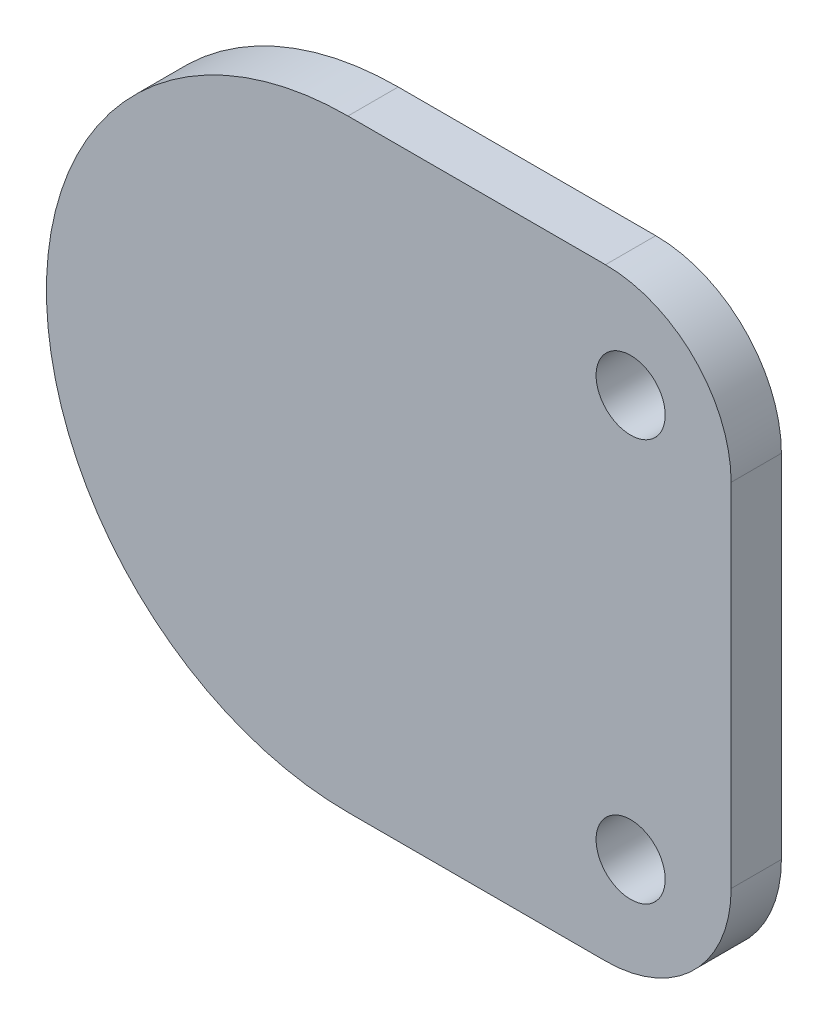
ISO-10303-21;
HEADER;
FILE_DESCRIPTION(('STEP AP214'),'2;1');
FILE_NAME('part.step','',(''),(''),'','','');
FILE_SCHEMA(('AUTOMOTIVE_DESIGN { 1 0 10303 214 1 1 1 1 }'));
ENDSEC;
DATA;
#1=APPLICATION_CONTEXT('core data for automotive mechanical design processes');
#2=APPLICATION_PROTOCOL_DEFINITION('international standard','automotive_design',2000,#1);
#3=PRODUCT_CONTEXT('',#1,'mechanical');
#4=PRODUCT('Part','Part','',(#3));
#5=PRODUCT_RELATED_PRODUCT_CATEGORY('part','',(#4));
#6=PRODUCT_DEFINITION_FORMATION('','',#4);
#7=PRODUCT_DEFINITION_CONTEXT('part definition',#1,'design');
#8=PRODUCT_DEFINITION('design','',#6,#7);
#9=PRODUCT_DEFINITION_SHAPE('','',#8);
#10=(LENGTH_UNIT() NAMED_UNIT(*) SI_UNIT(.MILLI.,.METRE.));
#11=(NAMED_UNIT(*) PLANE_ANGLE_UNIT() SI_UNIT($,.RADIAN.));
#12=(NAMED_UNIT(*) SI_UNIT($,.STERADIAN.) SOLID_ANGLE_UNIT());
#13=UNCERTAINTY_MEASURE_WITH_UNIT(LENGTH_MEASURE(1.E-05),#10,'distance_accuracy_value','');
#14=(GEOMETRIC_REPRESENTATION_CONTEXT(3) GLOBAL_UNCERTAINTY_ASSIGNED_CONTEXT((#13)) GLOBAL_UNIT_ASSIGNED_CONTEXT((#10,
#11,#12)) REPRESENTATION_CONTEXT('',''));
#15=CARTESIAN_POINT('',(0.,0.,0.));
#16=DIRECTION('',(0.,0.,1.));
#17=DIRECTION('',(1.,0.,0.));
#18=AXIS2_PLACEMENT_3D('',#15,#16,#17);
#19=CARTESIAN_POINT('',(0.,0.,4.));
#20=DIRECTION('',(0.,0.,1.));
#21=DIRECTION('',(1.,0.,0.));
#22=AXIS2_PLACEMENT_3D('',#19,#20,#21);
#23=PLANE('',#22);
#24=CARTESIAN_POINT('',(22.5,-16.,4.));
#25=DIRECTION('',(0.,0.,1.));
#26=DIRECTION('',(1.,0.,0.));
#27=AXIS2_PLACEMENT_3D('',#24,#25,#26);
#28=CIRCLE('',#27,2.74999999999999);
#29=CARTESIAN_POINT('',(25.25,-16.,4.));
#30=VERTEX_POINT('',#29);
#31=EDGE_CURVE('E126',#30,#30,#28,.T.);
#32=ORIENTED_EDGE('',*,*,#31,.F.);
#33=EDGE_LOOP('',(#32));
#34=FACE_BOUND('',#33,.T.);
#35=CARTESIAN_POINT('',(0.,0.,4.));
#36=DIRECTION('',(0.,0.,1.));
#37=DIRECTION('',(1.,0.,0.));
#38=AXIS2_PLACEMENT_3D('',#35,#36,#37);
#39=CIRCLE('',#38,24.);
#40=CARTESIAN_POINT('',(0.,24.,4.));
#41=VERTEX_POINT('',#40);
#42=CARTESIAN_POINT('',(0.,-24.,4.));
#43=VERTEX_POINT('',#42);
#44=EDGE_CURVE('E133',#41,#43,#39,.T.);
#45=ORIENTED_EDGE('',*,*,#44,.T.);
#46=DIRECTION('',(1.,0.,0.));
#47=VECTOR('',#46,1.);
#48=CARTESIAN_POINT('',(0.,-24.,4.));
#49=LINE('',#48,#47);
#50=CARTESIAN_POINT('',(20.5,-24.,4.));
#51=VERTEX_POINT('',#50);
#52=EDGE_CURVE('E91',#43,#51,#49,.T.);
#53=ORIENTED_EDGE('',*,*,#52,.T.);
#54=CARTESIAN_POINT('',(20.5,-14.,4.));
#55=DIRECTION('',(0.,0.,1.));
#56=DIRECTION('',(1.,0.,0.));
#57=AXIS2_PLACEMENT_3D('',#54,#55,#56);
#58=CIRCLE('',#57,10.);
#59=CARTESIAN_POINT('',(30.5,-14.,4.));
#60=VERTEX_POINT('',#59);
#61=EDGE_CURVE('E104',#51,#60,#58,.T.);
#62=ORIENTED_EDGE('',*,*,#61,.T.);
#63=DIRECTION('',(0.,1.,0.));
#64=VECTOR('',#63,1.);
#65=CARTESIAN_POINT('',(30.5,-14.,4.));
#66=LINE('',#65,#64);
#67=CARTESIAN_POINT('',(30.5,14.,4.));
#68=VERTEX_POINT('',#67);
#69=EDGE_CURVE('E98',#60,#68,#66,.T.);
#70=ORIENTED_EDGE('',*,*,#69,.T.);
#71=CARTESIAN_POINT('',(20.5,14.,4.));
#72=DIRECTION('',(0.,0.,1.));
#73=DIRECTION('',(1.,0.,0.));
#74=AXIS2_PLACEMENT_3D('',#71,#72,#73);
#75=CIRCLE('',#74,10.);
#76=CARTESIAN_POINT('',(20.5,24.,4.));
#77=VERTEX_POINT('',#76);
#78=EDGE_CURVE('E102',#68,#77,#75,.T.);
#79=ORIENTED_EDGE('',*,*,#78,.T.);
#80=DIRECTION('',(-1.,0.,0.));
#81=VECTOR('',#80,1.);
#82=CARTESIAN_POINT('',(20.5,24.,4.));
#83=LINE('',#82,#81);
#84=EDGE_CURVE('E53',#77,#41,#83,.T.);
#85=ORIENTED_EDGE('',*,*,#84,.T.);
#86=EDGE_LOOP('',(#45,#53,#62,#70,#79,#85));
#87=FACE_BOUND('',#86,.T.);
#88=CARTESIAN_POINT('',(22.5,16.,4.));
#89=DIRECTION('',(0.,0.,1.));
#90=DIRECTION('',(1.,0.,0.));
#91=AXIS2_PLACEMENT_3D('',#88,#89,#90);
#92=CIRCLE('',#91,2.74999999999999);
#93=CARTESIAN_POINT('',(25.25,16.,4.));
#94=VERTEX_POINT('',#93);
#95=EDGE_CURVE('E156',#94,#94,#92,.T.);
#96=ORIENTED_EDGE('',*,*,#95,.F.);
#97=EDGE_LOOP('',(#96));
#98=FACE_BOUND('',#97,.T.);
#99=ADVANCED_FACE('F36',(#34,#87,#98),#23,.T.);
#100=CARTESIAN_POINT('',(0.,0.,0.));
#101=DIRECTION('',(0.,0.,1.));
#102=DIRECTION('',(1.,0.,0.));
#103=AXIS2_PLACEMENT_3D('',#100,#101,#102);
#104=PLANE('',#103);
#105=CARTESIAN_POINT('',(0.,0.,0.));
#106=DIRECTION('',(0.,0.,1.));
#107=DIRECTION('',(1.,0.,0.));
#108=AXIS2_PLACEMENT_3D('',#105,#106,#107);
#109=CIRCLE('',#108,16.);
#110=CARTESIAN_POINT('',(16.,0.,0.));
#111=VERTEX_POINT('',#110);
#112=EDGE_CURVE('E11',#111,#111,#109,.F.);
#113=ORIENTED_EDGE('',*,*,#112,.F.);
#114=EDGE_LOOP('',(#113));
#115=FACE_BOUND('',#114,.T.);
#116=CARTESIAN_POINT('',(0.,0.,0.));
#117=DIRECTION('',(0.,0.,1.));
#118=DIRECTION('',(1.,0.,0.));
#119=AXIS2_PLACEMENT_3D('',#116,#117,#118);
#120=CIRCLE('',#119,24.);
#121=CARTESIAN_POINT('',(0.,24.,0.));
#122=VERTEX_POINT('',#121);
#123=CARTESIAN_POINT('',(0.,-24.,0.));
#124=VERTEX_POINT('',#123);
#125=EDGE_CURVE('E122',#122,#124,#120,.T.);
#126=ORIENTED_EDGE('',*,*,#125,.F.);
#127=DIRECTION('',(-1.,0.,0.));
#128=VECTOR('',#127,1.);
#129=CARTESIAN_POINT('',(20.5,24.,0.));
#130=LINE('',#129,#128);
#131=CARTESIAN_POINT('',(20.5,24.,0.));
#132=VERTEX_POINT('',#131);
#133=EDGE_CURVE('E82',#132,#122,#130,.T.);
#134=ORIENTED_EDGE('',*,*,#133,.F.);
#135=CARTESIAN_POINT('',(20.5,14.,0.));
#136=DIRECTION('',(0.,0.,1.));
#137=DIRECTION('',(1.,0.,0.));
#138=AXIS2_PLACEMENT_3D('',#135,#136,#137);
#139=CIRCLE('',#138,10.);
#140=CARTESIAN_POINT('',(30.5,14.,0.));
#141=VERTEX_POINT('',#140);
#142=EDGE_CURVE('E76',#141,#132,#139,.T.);
#143=ORIENTED_EDGE('',*,*,#142,.F.);
#144=DIRECTION('',(0.,1.,0.));
#145=VECTOR('',#144,1.);
#146=CARTESIAN_POINT('',(30.5,-14.,0.));
#147=LINE('',#146,#145);
#148=CARTESIAN_POINT('',(30.5,-14.,0.));
#149=VERTEX_POINT('',#148);
#150=EDGE_CURVE('E112',#149,#141,#147,.T.);
#151=ORIENTED_EDGE('',*,*,#150,.F.);
#152=CARTESIAN_POINT('',(20.5,-14.,0.));
#153=DIRECTION('',(0.,0.,1.));
#154=DIRECTION('',(1.,0.,0.));
#155=AXIS2_PLACEMENT_3D('',#152,#153,#154);
#156=CIRCLE('',#155,10.);
#157=CARTESIAN_POINT('',(20.5,-24.,0.));
#158=VERTEX_POINT('',#157);
#159=EDGE_CURVE('E128',#158,#149,#156,.T.);
#160=ORIENTED_EDGE('',*,*,#159,.F.);
#161=DIRECTION('',(1.,0.,0.));
#162=VECTOR('',#161,1.);
#163=CARTESIAN_POINT('',(0.,-24.,0.));
#164=LINE('',#163,#162);
#165=EDGE_CURVE('E125',#124,#158,#164,.T.);
#166=ORIENTED_EDGE('',*,*,#165,.F.);
#167=EDGE_LOOP('',(#126,#134,#143,#151,#160,#166));
#168=FACE_BOUND('',#167,.T.);
#169=CARTESIAN_POINT('',(22.5,-16.,0.));
#170=DIRECTION('',(0.,0.,1.));
#171=DIRECTION('',(1.,0.,0.));
#172=AXIS2_PLACEMENT_3D('',#169,#170,#171);
#173=CIRCLE('',#172,2.74999999999999);
#174=CARTESIAN_POINT('',(25.25,-16.,0.));
#175=VERTEX_POINT('',#174);
#176=EDGE_CURVE('E153',#175,#175,#173,.T.);
#177=ORIENTED_EDGE('',*,*,#176,.T.);
#178=EDGE_LOOP('',(#177));
#179=FACE_BOUND('',#178,.T.);
#180=CARTESIAN_POINT('',(22.5,16.,0.));
#181=DIRECTION('',(0.,0.,1.));
#182=DIRECTION('',(1.,0.,0.));
#183=AXIS2_PLACEMENT_3D('',#180,#181,#182);
#184=CIRCLE('',#183,2.74999999999999);
#185=CARTESIAN_POINT('',(25.25,16.,0.));
#186=VERTEX_POINT('',#185);
#187=EDGE_CURVE('E159',#186,#186,#184,.T.);
#188=ORIENTED_EDGE('',*,*,#187,.T.);
#189=EDGE_LOOP('',(#188));
#190=FACE_BOUND('',#189,.T.);
#191=ADVANCED_FACE('F145',(#115,#168,#179,#190),#104,.F.);
#192=CARTESIAN_POINT('',(0.,0.,4.));
#193=DIRECTION('',(0.,0.,-1.));
#194=DIRECTION('',(-1.,0.,0.));
#195=AXIS2_PLACEMENT_3D('',#192,#193,#194);
#196=CYLINDRICAL_SURFACE('',#195,24.);
#197=ORIENTED_EDGE('',*,*,#125,.T.);
#198=DIRECTION('',(0.,0.,-1.));
#199=VECTOR('',#198,1.);
#200=CARTESIAN_POINT('',(0.,-24.,4.));
#201=LINE('',#200,#199);
#202=EDGE_CURVE('E45',#43,#124,#201,.T.);
#203=ORIENTED_EDGE('',*,*,#202,.F.);
#204=ORIENTED_EDGE('',*,*,#44,.F.);
#205=DIRECTION('',(0.,0.,-1.));
#206=VECTOR('',#205,1.);
#207=CARTESIAN_POINT('',(0.,24.,4.));
#208=LINE('',#207,#206);
#209=EDGE_CURVE('E118',#41,#122,#208,.T.);
#210=ORIENTED_EDGE('',*,*,#209,.T.);
#211=EDGE_LOOP('',(#197,#203,#204,#210));
#212=FACE_BOUND('',#211,.T.);
#213=ADVANCED_FACE('F38',(#212),#196,.T.);
#214=CARTESIAN_POINT('',(0.,-24.,4.));
#215=DIRECTION('',(0.,1.,0.));
#216=DIRECTION('',(0.,0.,1.));
#217=AXIS2_PLACEMENT_3D('',#214,#215,#216);
#218=PLANE('',#217);
#219=ORIENTED_EDGE('',*,*,#165,.T.);
#220=DIRECTION('',(0.,0.,-1.));
#221=VECTOR('',#220,1.);
#222=CARTESIAN_POINT('',(20.5,-24.,4.));
#223=LINE('',#222,#221);
#224=EDGE_CURVE('E137',#51,#158,#223,.T.);
#225=ORIENTED_EDGE('',*,*,#224,.F.);
#226=ORIENTED_EDGE('',*,*,#52,.F.);
#227=ORIENTED_EDGE('',*,*,#202,.T.);
#228=EDGE_LOOP('',(#219,#225,#226,#227));
#229=FACE_BOUND('',#228,.T.);
#230=ADVANCED_FACE('F140',(#229),#218,.F.);
#231=CARTESIAN_POINT('',(20.5,-14.,4.));
#232=DIRECTION('',(0.,0.,-1.));
#233=DIRECTION('',(-1.,0.,0.));
#234=AXIS2_PLACEMENT_3D('',#231,#232,#233);
#235=CYLINDRICAL_SURFACE('',#234,10.);
#236=ORIENTED_EDGE('',*,*,#159,.T.);
#237=DIRECTION('',(0.,0.,-1.));
#238=VECTOR('',#237,1.);
#239=CARTESIAN_POINT('',(30.5,-14.,4.));
#240=LINE('',#239,#238);
#241=EDGE_CURVE('E113',#60,#149,#240,.T.);
#242=ORIENTED_EDGE('',*,*,#241,.F.);
#243=ORIENTED_EDGE('',*,*,#61,.F.);
#244=ORIENTED_EDGE('',*,*,#224,.T.);
#245=EDGE_LOOP('',(#236,#242,#243,#244));
#246=FACE_BOUND('',#245,.T.);
#247=ADVANCED_FACE('F149',(#246),#235,.T.);
#248=CARTESIAN_POINT('',(30.5,-14.,4.));
#249=DIRECTION('',(-1.,0.,0.));
#250=DIRECTION('',(0.,-1.,0.));
#251=AXIS2_PLACEMENT_3D('',#248,#249,#250);
#252=PLANE('',#251);
#253=ORIENTED_EDGE('',*,*,#150,.T.);
#254=DIRECTION('',(0.,0.,-1.));
#255=VECTOR('',#254,1.);
#256=CARTESIAN_POINT('',(30.5,14.,4.));
#257=LINE('',#256,#255);
#258=EDGE_CURVE('E109',#68,#141,#257,.T.);
#259=ORIENTED_EDGE('',*,*,#258,.F.);
#260=ORIENTED_EDGE('',*,*,#69,.F.);
#261=ORIENTED_EDGE('',*,*,#241,.T.);
#262=EDGE_LOOP('',(#253,#259,#260,#261));
#263=FACE_BOUND('',#262,.T.);
#264=ADVANCED_FACE('F110',(#263),#252,.F.);
#265=CARTESIAN_POINT('',(20.5,14.,4.));
#266=DIRECTION('',(0.,0.,-1.));
#267=DIRECTION('',(-1.,0.,0.));
#268=AXIS2_PLACEMENT_3D('',#265,#266,#267);
#269=CYLINDRICAL_SURFACE('',#268,10.);
#270=ORIENTED_EDGE('',*,*,#142,.T.);
#271=DIRECTION('',(0.,0.,-1.));
#272=VECTOR('',#271,1.);
#273=CARTESIAN_POINT('',(20.5,24.,4.));
#274=LINE('',#273,#272);
#275=EDGE_CURVE('E114',#77,#132,#274,.T.);
#276=ORIENTED_EDGE('',*,*,#275,.F.);
#277=ORIENTED_EDGE('',*,*,#78,.F.);
#278=ORIENTED_EDGE('',*,*,#258,.T.);
#279=EDGE_LOOP('',(#270,#276,#277,#278));
#280=FACE_BOUND('',#279,.T.);
#281=ADVANCED_FACE('F116',(#280),#269,.T.);
#282=CARTESIAN_POINT('',(20.5,24.,4.));
#283=DIRECTION('',(0.,-1.,0.));
#284=DIRECTION('',(0.,0.,-1.));
#285=AXIS2_PLACEMENT_3D('',#282,#283,#284);
#286=PLANE('',#285);
#287=ORIENTED_EDGE('',*,*,#133,.T.);
#288=ORIENTED_EDGE('',*,*,#209,.F.);
#289=ORIENTED_EDGE('',*,*,#84,.F.);
#290=ORIENTED_EDGE('',*,*,#275,.T.);
#291=EDGE_LOOP('',(#287,#288,#289,#290));
#292=FACE_BOUND('',#291,.T.);
#293=ADVANCED_FACE('F205',(#292),#286,.F.);
#294=CARTESIAN_POINT('',(22.5,-16.,4.));
#295=DIRECTION('',(0.,0.,-1.));
#296=DIRECTION('',(-1.,0.,0.));
#297=AXIS2_PLACEMENT_3D('',#294,#295,#296);
#298=CYLINDRICAL_SURFACE('',#297,2.74999999999999);
#299=ORIENTED_EDGE('',*,*,#31,.T.);
#300=EDGE_LOOP('',(#299));
#301=FACE_BOUND('',#300,.T.);
#302=ORIENTED_EDGE('',*,*,#176,.F.);
#303=EDGE_LOOP('',(#302));
#304=FACE_BOUND('',#303,.T.);
#305=ADVANCED_FACE('F189',(#301,#304),#298,.F.);
#306=CARTESIAN_POINT('',(22.5,16.,4.));
#307=DIRECTION('',(0.,0.,-1.));
#308=DIRECTION('',(-1.,0.,0.));
#309=AXIS2_PLACEMENT_3D('',#306,#307,#308);
#310=CYLINDRICAL_SURFACE('',#309,2.74999999999999);
#311=ORIENTED_EDGE('',*,*,#95,.T.);
#312=EDGE_LOOP('',(#311));
#313=FACE_BOUND('',#312,.T.);
#314=ORIENTED_EDGE('',*,*,#187,.F.);
#315=EDGE_LOOP('',(#314));
#316=FACE_BOUND('',#315,.T.);
#317=ADVANCED_FACE('F180',(#313,#316),#310,.F.);
#318=CARTESIAN_POINT('',(0.,0.,-6.));
#319=DIRECTION('',(0.,0.,-1.));
#320=DIRECTION('',(-1.,0.,0.));
#321=AXIS2_PLACEMENT_3D('',#318,#319,#320);
#322=PLANE('',#321);
#323=CARTESIAN_POINT('',(0.,0.,-6.));
#324=DIRECTION('',(0.,0.,-1.));
#325=DIRECTION('',(-1.,0.,0.));
#326=AXIS2_PLACEMENT_3D('',#323,#324,#325);
#327=CIRCLE('',#326,16.);
#328=CARTESIAN_POINT('',(-16.,0.,-6.));
#329=VERTEX_POINT('',#328);
#330=EDGE_CURVE('E162',#329,#329,#327,.T.);
#331=ORIENTED_EDGE('',*,*,#330,.T.);
#332=EDGE_LOOP('',(#331));
#333=FACE_BOUND('',#332,.T.);
#334=CARTESIAN_POINT('',(0.,0.,-6.));
#335=DIRECTION('',(0.,0.,-1.));
#336=DIRECTION('',(-1.,0.,0.));
#337=AXIS2_PLACEMENT_3D('',#334,#335,#336);
#338=CIRCLE('',#337,14.);
#339=CARTESIAN_POINT('',(-14.,0.,-6.));
#340=VERTEX_POINT('',#339);
#341=EDGE_CURVE('E167',#340,#340,#338,.T.);
#342=ORIENTED_EDGE('',*,*,#341,.F.);
#343=EDGE_LOOP('',(#342));
#344=FACE_BOUND('',#343,.T.);
#345=ADVANCED_FACE('F177',(#333,#344),#322,.T.);
#346=CARTESIAN_POINT('',(0.,0.,-6.));
#347=DIRECTION('',(0.,0.,1.));
#348=DIRECTION('',(1.,0.,0.));
#349=AXIS2_PLACEMENT_3D('',#346,#347,#348);
#350=CYLINDRICAL_SURFACE('',#349,16.);
#351=ORIENTED_EDGE('',*,*,#330,.F.);
#352=EDGE_LOOP('',(#351));
#353=FACE_BOUND('',#352,.T.);
#354=ORIENTED_EDGE('',*,*,#112,.T.);
#355=EDGE_LOOP('',(#354));
#356=FACE_BOUND('',#355,.T.);
#357=ADVANCED_FACE('F179',(#353,#356),#350,.T.);
#358=CARTESIAN_POINT('',(0.,0.,-6.));
#359=DIRECTION('',(0.,0.,1.));
#360=DIRECTION('',(1.,0.,0.));
#361=AXIS2_PLACEMENT_3D('',#358,#359,#360);
#362=CYLINDRICAL_SURFACE('',#361,14.);
#363=ORIENTED_EDGE('',*,*,#341,.T.);
#364=EDGE_LOOP('',(#363));
#365=FACE_BOUND('',#364,.T.);
#366=CARTESIAN_POINT('',(0.,0.,0.));
#367=DIRECTION('',(0.,0.,-1.));
#368=DIRECTION('',(-1.,0.,0.));
#369=AXIS2_PLACEMENT_3D('',#366,#367,#368);
#370=CIRCLE('',#369,14.);
#371=CARTESIAN_POINT('',(-14.,0.,0.));
#372=VERTEX_POINT('',#371);
#373=EDGE_CURVE('E168',#372,#372,#370,.T.);
#374=ORIENTED_EDGE('',*,*,#373,.F.);
#375=EDGE_LOOP('',(#374));
#376=FACE_BOUND('',#375,.T.);
#377=ADVANCED_FACE('F174',(#365,#376),#362,.F.);
#378=ORIENTED_EDGE('',*,*,#373,.T.);
#379=EDGE_LOOP('',(#378));
#380=FACE_BOUND('',#379,.T.);
#381=ADVANCED_FACE('F201',(#380),#104,.F.);
#382=CLOSED_SHELL('',(#99,#191,#213,#230,#247,#264,#281,#293,#305,#317,#345,#357,#377,#381));
#383=MANIFOLD_SOLID_BREP('B2',#382);
#384=ADVANCED_BREP_SHAPE_REPRESENTATION('',(#18,#383),#14);
#385=SHAPE_DEFINITION_REPRESENTATION(#9,#384);
ENDSEC;
END-ISO-10303-21;
